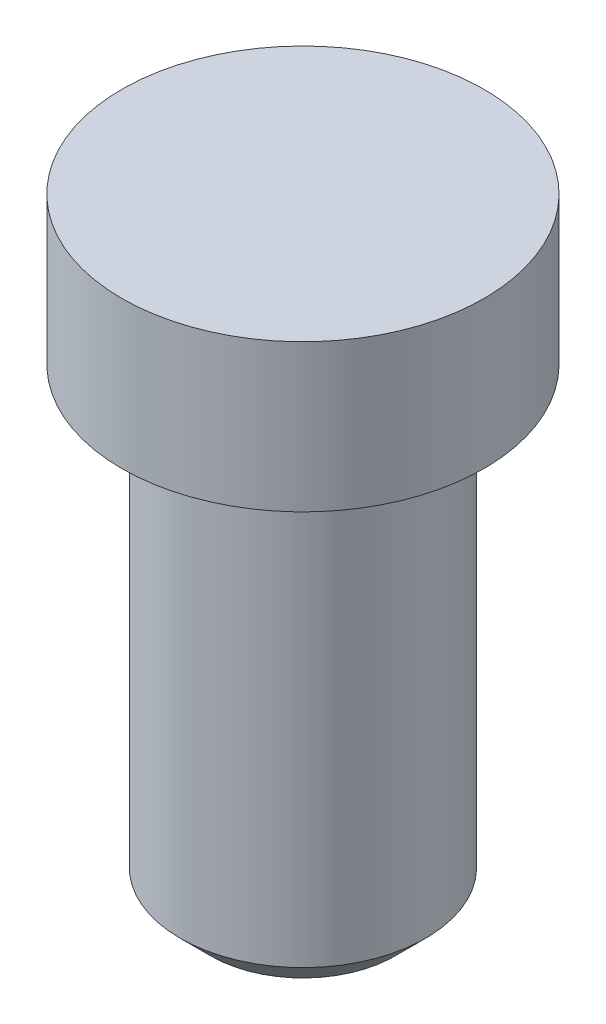
ISO-10303-21;
HEADER;
FILE_DESCRIPTION(('STEP AP214'),'2;1');
FILE_NAME('part.step','',(''),(''),'','','');
FILE_SCHEMA(('AUTOMOTIVE_DESIGN { 1 0 10303 214 1 1 1 1 }'));
ENDSEC;
DATA;
#1=APPLICATION_CONTEXT('core data for automotive mechanical design processes');
#2=APPLICATION_PROTOCOL_DEFINITION('international standard','automotive_design',2000,#1);
#3=PRODUCT_CONTEXT('',#1,'mechanical');
#4=PRODUCT('Part','Part','',(#3));
#5=PRODUCT_RELATED_PRODUCT_CATEGORY('part','',(#4));
#6=PRODUCT_DEFINITION_FORMATION('','',#4);
#7=PRODUCT_DEFINITION_CONTEXT('part definition',#1,'design');
#8=PRODUCT_DEFINITION('design','',#6,#7);
#9=PRODUCT_DEFINITION_SHAPE('','',#8);
#10=(LENGTH_UNIT() NAMED_UNIT(*) SI_UNIT(.MILLI.,.METRE.));
#11=(NAMED_UNIT(*) PLANE_ANGLE_UNIT() SI_UNIT($,.RADIAN.));
#12=(NAMED_UNIT(*) SI_UNIT($,.STERADIAN.) SOLID_ANGLE_UNIT());
#13=UNCERTAINTY_MEASURE_WITH_UNIT(LENGTH_MEASURE(1.E-05),#10,'distance_accuracy_value','');
#14=(GEOMETRIC_REPRESENTATION_CONTEXT(3) GLOBAL_UNCERTAINTY_ASSIGNED_CONTEXT((#13)) GLOBAL_UNIT_ASSIGNED_CONTEXT((#10,
#11,#12)) REPRESENTATION_CONTEXT('',''));
#15=CARTESIAN_POINT('',(0.,0.,0.));
#16=DIRECTION('',(0.,0.,1.));
#17=DIRECTION('',(1.,0.,0.));
#18=AXIS2_PLACEMENT_3D('',#15,#16,#17);
#19=CARTESIAN_POINT('',(0.,0.,0.));
#20=DIRECTION('',(0.,-1.,0.));
#21=DIRECTION('',(0.,0.,-1.));
#22=AXIS2_PLACEMENT_3D('',#19,#20,#21);
#23=PLANE('',#22);
#24=CARTESIAN_POINT('',(0.,0.,0.));
#25=DIRECTION('',(0.,1.,0.));
#26=DIRECTION('',(0.,0.,1.));
#27=AXIS2_PLACEMENT_3D('',#24,#25,#26);
#28=CIRCLE('',#27,2.95);
#29=CARTESIAN_POINT('',(0.,0.,2.95));
#30=VERTEX_POINT('',#29);
#31=EDGE_CURVE('E42',#30,#30,#28,.T.);
#32=ORIENTED_EDGE('',*,*,#31,.T.);
#33=EDGE_LOOP('',(#32));
#34=FACE_BOUND('',#33,.T.);
#35=ADVANCED_FACE('F31',(#34),#23,.F.);
#36=CARTESIAN_POINT('',(0.,0.,0.));
#37=DIRECTION('',(0.,1.,0.));
#38=DIRECTION('',(0.,0.,1.));
#39=AXIS2_PLACEMENT_3D('',#36,#37,#38);
#40=CYLINDRICAL_SURFACE('',#39,2.95);
#41=ORIENTED_EDGE('',*,*,#31,.F.);
#42=EDGE_LOOP('',(#41));
#43=FACE_BOUND('',#42,.T.);
#44=CARTESIAN_POINT('',(0.,-2.4,0.));
#45=DIRECTION('',(0.,1.,0.));
#46=DIRECTION('',(0.,0.,1.));
#47=AXIS2_PLACEMENT_3D('',#44,#45,#46);
#48=CIRCLE('',#47,2.95);
#49=CARTESIAN_POINT('',(0.,-2.4,2.95));
#50=VERTEX_POINT('',#49);
#51=EDGE_CURVE('E46',#50,#50,#48,.T.);
#52=ORIENTED_EDGE('',*,*,#51,.T.);
#53=EDGE_LOOP('',(#52));
#54=FACE_BOUND('',#53,.T.);
#55=ADVANCED_FACE('F66',(#43,#54),#40,.T.);
#56=CARTESIAN_POINT('',(2.95,-2.4,0.));
#57=DIRECTION('',(0.,1.,0.));
#58=DIRECTION('',(0.,0.,1.));
#59=AXIS2_PLACEMENT_3D('',#56,#57,#58);
#60=PLANE('',#59);
#61=ORIENTED_EDGE('',*,*,#51,.F.);
#62=EDGE_LOOP('',(#61));
#63=FACE_BOUND('',#62,.T.);
#64=CARTESIAN_POINT('',(0.,-2.4,0.));
#65=DIRECTION('',(0.,1.,0.));
#66=DIRECTION('',(0.,0.,1.));
#67=AXIS2_PLACEMENT_3D('',#64,#65,#66);
#68=CIRCLE('',#67,2.);
#69=CARTESIAN_POINT('',(0.,-2.4,2.));
#70=VERTEX_POINT('',#69);
#71=EDGE_CURVE('E51',#70,#70,#68,.T.);
#72=ORIENTED_EDGE('',*,*,#71,.T.);
#73=EDGE_LOOP('',(#72));
#74=FACE_BOUND('',#73,.T.);
#75=ADVANCED_FACE('F55',(#63,#74),#60,.F.);
#76=CARTESIAN_POINT('',(0.,0.,0.));
#77=DIRECTION('',(0.,1.,0.));
#78=DIRECTION('',(0.,0.,1.));
#79=AXIS2_PLACEMENT_3D('',#76,#77,#78);
#80=CYLINDRICAL_SURFACE('',#79,2.);
#81=CARTESIAN_POINT('',(0.,-9.5,0.));
#82=DIRECTION('',(0.,1.,0.));
#83=DIRECTION('',(0.,0.,1.));
#84=AXIS2_PLACEMENT_3D('',#81,#82,#83);
#85=CIRCLE('',#84,2.);
#86=CARTESIAN_POINT('',(0.,-9.5,2.));
#87=VERTEX_POINT('',#86);
#88=EDGE_CURVE('E38',#87,#87,#85,.T.);
#89=ORIENTED_EDGE('',*,*,#88,.T.);
#90=EDGE_LOOP('',(#89));
#91=FACE_BOUND('',#90,.T.);
#92=ORIENTED_EDGE('',*,*,#71,.F.);
#93=EDGE_LOOP('',(#92));
#94=FACE_BOUND('',#93,.T.);
#95=ADVANCED_FACE('F57',(#91,#94),#80,.T.);
#96=CARTESIAN_POINT('',(2.,-10.,0.));
#97=DIRECTION('',(0.,1.,0.));
#98=DIRECTION('',(0.,0.,1.));
#99=AXIS2_PLACEMENT_3D('',#96,#97,#98);
#100=PLANE('',#99);
#101=CARTESIAN_POINT('',(0.,-10.,0.));
#102=DIRECTION('',(0.,1.,0.));
#103=DIRECTION('',(0.,0.,1.));
#104=AXIS2_PLACEMENT_3D('',#101,#102,#103);
#105=CIRCLE('',#104,1.5);
#106=CARTESIAN_POINT('',(0.,-10.,1.5));
#107=VERTEX_POINT('',#106);
#108=EDGE_CURVE('E10',#107,#107,#105,.F.);
#109=ORIENTED_EDGE('',*,*,#108,.T.);
#110=EDGE_LOOP('',(#109));
#111=FACE_BOUND('',#110,.T.);
#112=ADVANCED_FACE('F59',(#111),#100,.F.);
#113=CARTESIAN_POINT('',(0.,-9.5,0.));
#114=DIRECTION('',(0.,1.,0.));
#115=DIRECTION('',(0.,0.,1.));
#116=AXIS2_PLACEMENT_3D('',#113,#114,#115);
#117=CONICAL_SURFACE('',#116,2.,0.78539816339745);
#118=ORIENTED_EDGE('',*,*,#108,.F.);
#119=EDGE_LOOP('',(#118));
#120=FACE_BOUND('',#119,.T.);
#121=ORIENTED_EDGE('',*,*,#88,.F.);
#122=EDGE_LOOP('',(#121));
#123=FACE_BOUND('',#122,.T.);
#124=ADVANCED_FACE('F33',(#120,#123),#117,.T.);
#125=CLOSED_SHELL('',(#35,#55,#75,#95,#112,#124));
#126=MANIFOLD_SOLID_BREP('B2',#125);
#127=ADVANCED_BREP_SHAPE_REPRESENTATION('',(#18,#126),#14);
#128=SHAPE_DEFINITION_REPRESENTATION(#9,#127);
ENDSEC;
END-ISO-10303-21;
